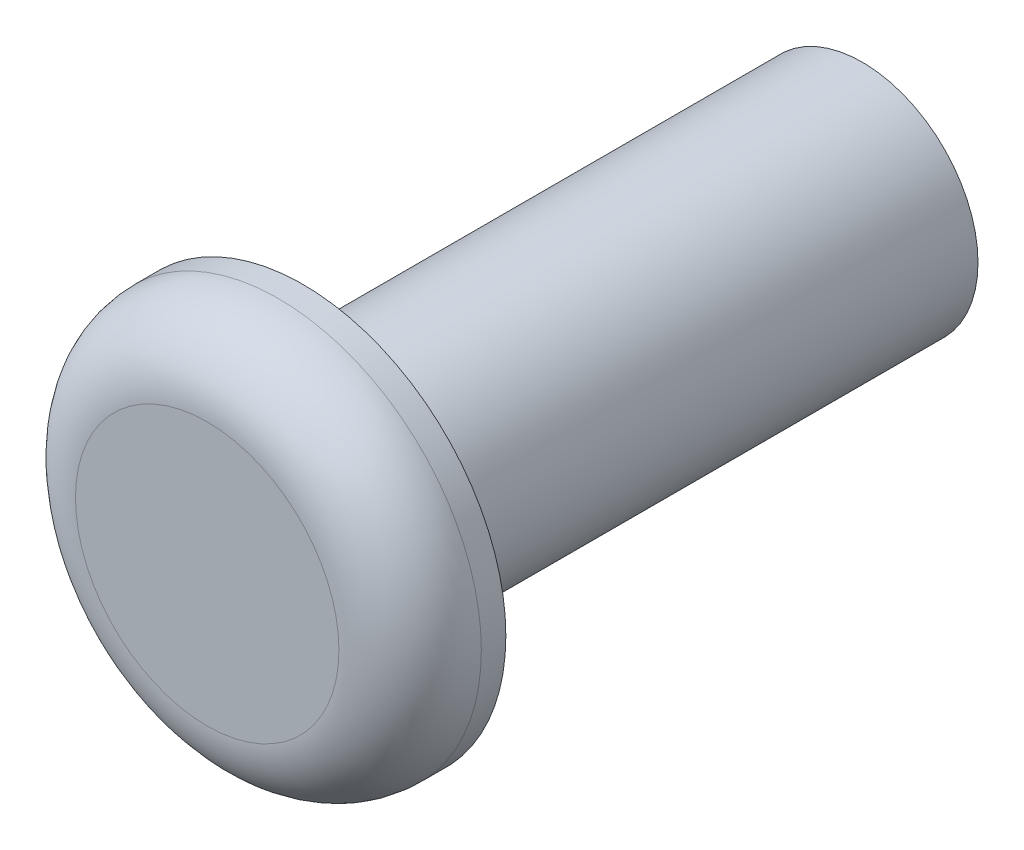
ISO-10303-21;
HEADER;
FILE_DESCRIPTION(('STEP AP214'),'2;1');
FILE_NAME('part.step','',(''),(''),'','','');
FILE_SCHEMA(('AUTOMOTIVE_DESIGN { 1 0 10303 214 1 1 1 1 }'));
ENDSEC;
DATA;
#1=APPLICATION_CONTEXT('core data for automotive mechanical design processes');
#2=APPLICATION_PROTOCOL_DEFINITION('international standard','automotive_design',2000,#1);
#3=PRODUCT_CONTEXT('',#1,'mechanical');
#4=PRODUCT('Part','Part','',(#3));
#5=PRODUCT_RELATED_PRODUCT_CATEGORY('part','',(#4));
#6=PRODUCT_DEFINITION_FORMATION('','',#4);
#7=PRODUCT_DEFINITION_CONTEXT('part definition',#1,'design');
#8=PRODUCT_DEFINITION('design','',#6,#7);
#9=PRODUCT_DEFINITION_SHAPE('','',#8);
#10=(LENGTH_UNIT() NAMED_UNIT(*) SI_UNIT(.MILLI.,.METRE.));
#11=(NAMED_UNIT(*) PLANE_ANGLE_UNIT() SI_UNIT($,.RADIAN.));
#12=(NAMED_UNIT(*) SI_UNIT($,.STERADIAN.) SOLID_ANGLE_UNIT());
#13=UNCERTAINTY_MEASURE_WITH_UNIT(LENGTH_MEASURE(1.E-05),#10,'distance_accuracy_value','');
#14=(GEOMETRIC_REPRESENTATION_CONTEXT(3) GLOBAL_UNCERTAINTY_ASSIGNED_CONTEXT((#13)) GLOBAL_UNIT_ASSIGNED_CONTEXT((#10,
#11,#12)) REPRESENTATION_CONTEXT('',''));
#15=CARTESIAN_POINT('',(0.,0.,0.));
#16=DIRECTION('',(0.,0.,1.));
#17=DIRECTION('',(1.,0.,0.));
#18=AXIS2_PLACEMENT_3D('',#15,#16,#17);
#19=CARTESIAN_POINT('',(0.,0.,0.));
#20=DIRECTION('',(0.,0.,-1.));
#21=DIRECTION('',(-1.,0.,0.));
#22=AXIS2_PLACEMENT_3D('',#19,#20,#21);
#23=PLANE('',#22);
#24=CARTESIAN_POINT('',(0.,0.,0.));
#25=DIRECTION('',(0.,0.,1.));
#26=DIRECTION('',(1.,0.,0.));
#27=AXIS2_PLACEMENT_3D('',#24,#25,#26);
#28=CIRCLE('',#27,0.939799999999996);
#29=CARTESIAN_POINT('',(0.939799999999996,0.,0.));
#30=VERTEX_POINT('',#29);
#31=EDGE_CURVE('E10',#30,#30,#28,.T.);
#32=ORIENTED_EDGE('',*,*,#31,.T.);
#33=EDGE_LOOP('',(#32));
#34=FACE_BOUND('',#33,.T.);
#35=ADVANCED_FACE('F31',(#34),#23,.F.);
#36=CARTESIAN_POINT('',(0.,0.,-0.508));
#37=DIRECTION('',(0.,0.,1.));
#38=DIRECTION('',(1.,0.,0.));
#39=AXIS2_PLACEMENT_3D('',#36,#37,#38);
#40=TOROIDAL_SURFACE('',#39,0.939799999999999,0.508);
#41=ORIENTED_EDGE('',*,*,#31,.F.);
#42=EDGE_LOOP('',(#41));
#43=FACE_BOUND('',#42,.T.);
#44=CARTESIAN_POINT('',(0.,0.,-0.508000000000002));
#45=DIRECTION('',(0.,0.,1.));
#46=DIRECTION('',(1.,0.,0.));
#47=AXIS2_PLACEMENT_3D('',#44,#45,#46);
#48=CIRCLE('',#47,1.4478);
#49=CARTESIAN_POINT('',(1.4478,0.,-0.508000000000002));
#50=VERTEX_POINT('',#49);
#51=EDGE_CURVE('E37',#50,#50,#48,.T.);
#52=ORIENTED_EDGE('',*,*,#51,.T.);
#53=EDGE_LOOP('',(#52));
#54=FACE_BOUND('',#53,.T.);
#55=ADVANCED_FACE('F66',(#43,#54),#40,.T.);
#56=CARTESIAN_POINT('',(0.,0.,43.0288168684613));
#57=DIRECTION('',(0.,0.,1.));
#58=DIRECTION('',(1.,0.,0.));
#59=AXIS2_PLACEMENT_3D('',#56,#57,#58);
#60=CYLINDRICAL_SURFACE('',#59,1.4478);
#61=ORIENTED_EDGE('',*,*,#51,.F.);
#62=EDGE_LOOP('',(#61));
#63=FACE_BOUND('',#62,.T.);
#64=CARTESIAN_POINT('',(0.,0.,-0.682863214691076));
#65=DIRECTION('',(0.,0.,1.));
#66=DIRECTION('',(1.,0.,0.));
#67=AXIS2_PLACEMENT_3D('',#64,#65,#66);
#68=CIRCLE('',#67,1.4478);
#69=CARTESIAN_POINT('',(1.4478,0.,-0.682863214691076));
#70=VERTEX_POINT('',#69);
#71=EDGE_CURVE('E41',#70,#70,#68,.T.);
#72=ORIENTED_EDGE('',*,*,#71,.T.);
#73=EDGE_LOOP('',(#72));
#74=FACE_BOUND('',#73,.T.);
#75=ADVANCED_FACE('F70',(#63,#74),#60,.T.);
#76=CARTESIAN_POINT('',(0.,1.4478,-0.682863214691073));
#77=DIRECTION('',(0.,0.,1.));
#78=DIRECTION('',(1.,0.,0.));
#79=AXIS2_PLACEMENT_3D('',#76,#77,#78);
#80=PLANE('',#79);
#81=ORIENTED_EDGE('',*,*,#71,.F.);
#82=EDGE_LOOP('',(#81));
#83=FACE_BOUND('',#82,.T.);
#84=CARTESIAN_POINT('',(0.,0.,-0.682863214691076));
#85=DIRECTION('',(0.,0.,1.));
#86=DIRECTION('',(1.,0.,0.));
#87=AXIS2_PLACEMENT_3D('',#84,#85,#86);
#88=CIRCLE('',#87,0.825499999999999);
#89=CARTESIAN_POINT('',(0.825499999999999,0.,-0.682863214691076));
#90=VERTEX_POINT('',#89);
#91=EDGE_CURVE('E45',#90,#90,#88,.T.);
#92=ORIENTED_EDGE('',*,*,#91,.T.);
#93=EDGE_LOOP('',(#92));
#94=FACE_BOUND('',#93,.T.);
#95=ADVANCED_FACE('F62',(#83,#94),#80,.F.);
#96=CARTESIAN_POINT('',(0.,0.,43.0288168684613));
#97=DIRECTION('',(0.,0.,1.));
#98=DIRECTION('',(1.,0.,0.));
#99=AXIS2_PLACEMENT_3D('',#96,#97,#98);
#100=CYLINDRICAL_SURFACE('',#99,0.825499999999999);
#101=ORIENTED_EDGE('',*,*,#91,.F.);
#102=EDGE_LOOP('',(#101));
#103=FACE_BOUND('',#102,.T.);
#104=CARTESIAN_POINT('',(0.,0.,-4.6736));
#105=DIRECTION('',(0.,0.,1.));
#106=DIRECTION('',(1.,0.,0.));
#107=AXIS2_PLACEMENT_3D('',#104,#105,#106);
#108=CIRCLE('',#107,0.825499999999999);
#109=CARTESIAN_POINT('',(0.825499999999999,0.,-4.6736));
#110=VERTEX_POINT('',#109);
#111=EDGE_CURVE('E50',#110,#110,#108,.T.);
#112=ORIENTED_EDGE('',*,*,#111,.T.);
#113=EDGE_LOOP('',(#112));
#114=FACE_BOUND('',#113,.T.);
#115=ADVANCED_FACE('F54',(#103,#114),#100,.T.);
#116=CARTESIAN_POINT('',(0.,0.825499999999999,-4.6736));
#117=DIRECTION('',(0.,0.,1.));
#118=DIRECTION('',(1.,0.,0.));
#119=AXIS2_PLACEMENT_3D('',#116,#117,#118);
#120=PLANE('',#119);
#121=ORIENTED_EDGE('',*,*,#111,.F.);
#122=EDGE_LOOP('',(#121));
#123=FACE_BOUND('',#122,.T.);
#124=ADVANCED_FACE('F56',(#123),#120,.F.);
#125=CLOSED_SHELL('',(#35,#55,#75,#95,#115,#124));
#126=MANIFOLD_SOLID_BREP('B2',#125);
#127=ADVANCED_BREP_SHAPE_REPRESENTATION('',(#18,#126),#14);
#128=SHAPE_DEFINITION_REPRESENTATION(#9,#127);
ENDSEC;
END-ISO-10303-21;
